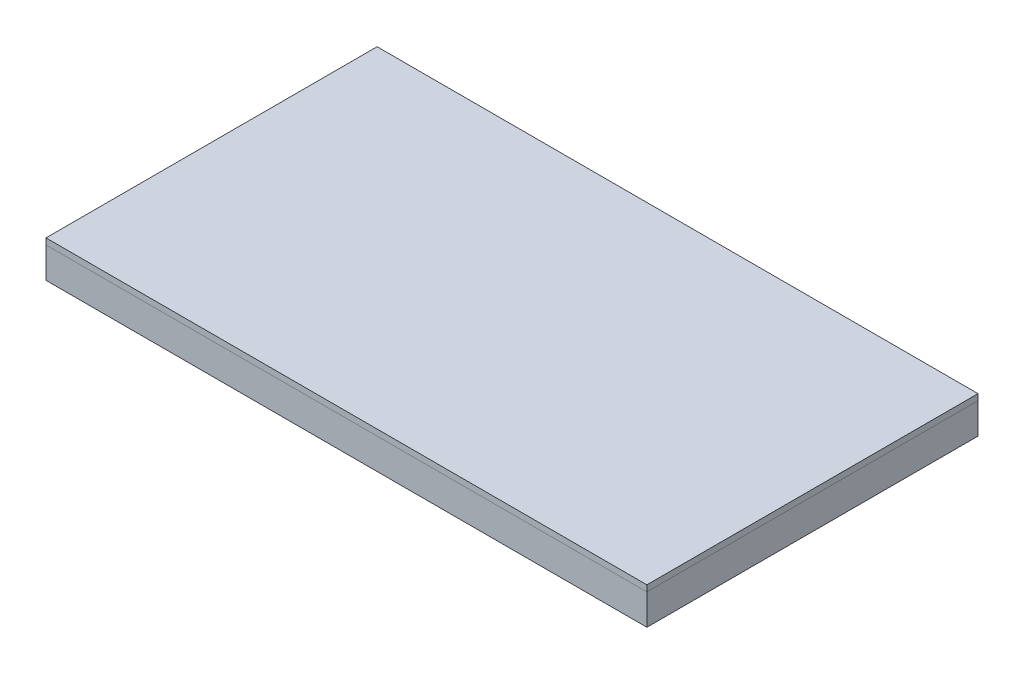
ISO-10303-21;
HEADER;
FILE_DESCRIPTION(('STEP AP214'),'2;1');
FILE_NAME('part.step','',(''),(''),'','','');
FILE_SCHEMA(('AUTOMOTIVE_DESIGN { 1 0 10303 214 1 1 1 1 }'));
ENDSEC;
DATA;
#1=APPLICATION_CONTEXT('core data for automotive mechanical design processes');
#2=APPLICATION_PROTOCOL_DEFINITION('international standard','automotive_design',2000,#1);
#3=PRODUCT_CONTEXT('',#1,'mechanical');
#4=PRODUCT('Part','Part','',(#3));
#5=PRODUCT_RELATED_PRODUCT_CATEGORY('part','',(#4));
#6=PRODUCT_DEFINITION_FORMATION('','',#4);
#7=PRODUCT_DEFINITION_CONTEXT('part definition',#1,'design');
#8=PRODUCT_DEFINITION('design','',#6,#7);
#9=PRODUCT_DEFINITION_SHAPE('','',#8);
#10=(LENGTH_UNIT() NAMED_UNIT(*) SI_UNIT(.MILLI.,.METRE.));
#11=(NAMED_UNIT(*) PLANE_ANGLE_UNIT() SI_UNIT($,.RADIAN.));
#12=(NAMED_UNIT(*) SI_UNIT($,.STERADIAN.) SOLID_ANGLE_UNIT());
#13=UNCERTAINTY_MEASURE_WITH_UNIT(LENGTH_MEASURE(1.E-05),#10,'distance_accuracy_value','');
#14=(GEOMETRIC_REPRESENTATION_CONTEXT(3) GLOBAL_UNCERTAINTY_ASSIGNED_CONTEXT((#13)) GLOBAL_UNIT_ASSIGNED_CONTEXT((#10,
#11,#12)) REPRESENTATION_CONTEXT('',''));
#15=CARTESIAN_POINT('',(0.,0.,0.));
#16=DIRECTION('',(0.,0.,1.));
#17=DIRECTION('',(1.,0.,0.));
#18=AXIS2_PLACEMENT_3D('',#15,#16,#17);
#19=CARTESIAN_POINT('',(490.,-50.,270.));
#20=DIRECTION('',(1.,0.,0.));
#21=DIRECTION('',(0.,0.,-1.));
#22=AXIS2_PLACEMENT_3D('',#19,#20,#21);
#23=PLANE('',#22);
#24=DIRECTION('',(0.,0.,-1.));
#25=VECTOR('',#24,1.);
#26=CARTESIAN_POINT('',(490.,0.,270.));
#27=LINE('',#26,#25);
#28=CARTESIAN_POINT('',(490.,0.,270.));
#29=VERTEX_POINT('',#28);
#30=CARTESIAN_POINT('',(490.,0.,-270.));
#31=VERTEX_POINT('',#30);
#32=EDGE_CURVE('E149',#29,#31,#27,.T.);
#33=ORIENTED_EDGE('',*,*,#32,.F.);
#34=DIRECTION('',(0.,1.,0.));
#35=VECTOR('',#34,1.);
#36=CARTESIAN_POINT('',(490.,-50.,270.));
#37=LINE('',#36,#35);
#38=CARTESIAN_POINT('',(490.,-50.,270.));
#39=VERTEX_POINT('',#38);
#40=EDGE_CURVE('E12',#39,#29,#37,.T.);
#41=ORIENTED_EDGE('',*,*,#40,.F.);
#42=DIRECTION('',(0.,0.,-1.));
#43=VECTOR('',#42,1.);
#44=CARTESIAN_POINT('',(490.,-50.,270.));
#45=LINE('',#44,#43);
#46=CARTESIAN_POINT('',(490.,-50.,-270.));
#47=VERTEX_POINT('',#46);
#48=EDGE_CURVE('E153',#39,#47,#45,.T.);
#49=ORIENTED_EDGE('',*,*,#48,.T.);
#50=DIRECTION('',(0.,1.,0.));
#51=VECTOR('',#50,1.);
#52=CARTESIAN_POINT('',(490.,-50.,-270.));
#53=LINE('',#52,#51);
#54=EDGE_CURVE('E54',#47,#31,#53,.T.);
#55=ORIENTED_EDGE('',*,*,#54,.T.);
#56=EDGE_LOOP('',(#33,#41,#49,#55));
#57=FACE_BOUND('',#56,.T.);
#58=ADVANCED_FACE('F51',(#57),#23,.T.);
#59=CARTESIAN_POINT('',(-490.,-50.,270.));
#60=DIRECTION('',(0.,0.,1.));
#61=DIRECTION('',(1.,0.,0.));
#62=AXIS2_PLACEMENT_3D('',#59,#60,#61);
#63=PLANE('',#62);
#64=DIRECTION('',(1.,0.,0.));
#65=VECTOR('',#64,1.);
#66=CARTESIAN_POINT('',(-490.,0.,270.));
#67=LINE('',#66,#65);
#68=CARTESIAN_POINT('',(-490.,0.,270.));
#69=VERTEX_POINT('',#68);
#70=EDGE_CURVE('E157',#69,#29,#67,.T.);
#71=ORIENTED_EDGE('',*,*,#70,.F.);
#72=DIRECTION('',(0.,1.,0.));
#73=VECTOR('',#72,1.);
#74=CARTESIAN_POINT('',(-490.,-50.,270.));
#75=LINE('',#74,#73);
#76=CARTESIAN_POINT('',(-490.,-50.,270.));
#77=VERTEX_POINT('',#76);
#78=EDGE_CURVE('E59',#77,#69,#75,.T.);
#79=ORIENTED_EDGE('',*,*,#78,.F.);
#80=DIRECTION('',(1.,0.,0.));
#81=VECTOR('',#80,1.);
#82=CARTESIAN_POINT('',(-490.,-50.,270.));
#83=LINE('',#82,#81);
#84=EDGE_CURVE('E163',#77,#39,#83,.T.);
#85=ORIENTED_EDGE('',*,*,#84,.T.);
#86=ORIENTED_EDGE('',*,*,#40,.T.);
#87=EDGE_LOOP('',(#71,#79,#85,#86));
#88=FACE_BOUND('',#87,.T.);
#89=ADVANCED_FACE('F189',(#88),#63,.T.);
#90=CARTESIAN_POINT('',(-490.,-50.,270.));
#91=DIRECTION('',(-1.,0.,0.));
#92=DIRECTION('',(0.,0.,1.));
#93=AXIS2_PLACEMENT_3D('',#90,#91,#92);
#94=PLANE('',#93);
#95=DIRECTION('',(0.,0.,1.));
#96=VECTOR('',#95,1.);
#97=CARTESIAN_POINT('',(-490.,0.,270.));
#98=LINE('',#97,#96);
#99=CARTESIAN_POINT('',(-490.,0.,-270.));
#100=VERTEX_POINT('',#99);
#101=EDGE_CURVE('E171',#100,#69,#98,.T.);
#102=ORIENTED_EDGE('',*,*,#101,.F.);
#103=DIRECTION('',(0.,1.,0.));
#104=VECTOR('',#103,1.);
#105=CARTESIAN_POINT('',(-490.,-50.,-270.));
#106=LINE('',#105,#104);
#107=CARTESIAN_POINT('',(-490.,-50.,-270.));
#108=VERTEX_POINT('',#107);
#109=EDGE_CURVE('E176',#108,#100,#106,.T.);
#110=ORIENTED_EDGE('',*,*,#109,.F.);
#111=DIRECTION('',(0.,0.,1.));
#112=VECTOR('',#111,1.);
#113=CARTESIAN_POINT('',(-490.,-50.,270.));
#114=LINE('',#113,#112);
#115=EDGE_CURVE('E160',#108,#77,#114,.T.);
#116=ORIENTED_EDGE('',*,*,#115,.T.);
#117=ORIENTED_EDGE('',*,*,#78,.T.);
#118=EDGE_LOOP('',(#102,#110,#116,#117));
#119=FACE_BOUND('',#118,.T.);
#120=ADVANCED_FACE('F193',(#119),#94,.T.);
#121=CARTESIAN_POINT('',(-490.,-50.,-270.));
#122=DIRECTION('',(0.,0.,-1.));
#123=DIRECTION('',(-1.,0.,0.));
#124=AXIS2_PLACEMENT_3D('',#121,#122,#123);
#125=PLANE('',#124);
#126=DIRECTION('',(-1.,0.,0.));
#127=VECTOR('',#126,1.);
#128=CARTESIAN_POINT('',(-490.,0.,-270.));
#129=LINE('',#128,#127);
#130=EDGE_CURVE('E168',#31,#100,#129,.T.);
#131=ORIENTED_EDGE('',*,*,#130,.F.);
#132=ORIENTED_EDGE('',*,*,#54,.F.);
#133=DIRECTION('',(-1.,0.,0.));
#134=VECTOR('',#133,1.);
#135=CARTESIAN_POINT('',(-490.,-50.,-270.));
#136=LINE('',#135,#134);
#137=EDGE_CURVE('E156',#47,#108,#136,.T.);
#138=ORIENTED_EDGE('',*,*,#137,.T.);
#139=ORIENTED_EDGE('',*,*,#109,.T.);
#140=EDGE_LOOP('',(#131,#132,#138,#139));
#141=FACE_BOUND('',#140,.T.);
#142=ADVANCED_FACE('F184',(#141),#125,.T.);
#143=CARTESIAN_POINT('',(0.,-50.,0.));
#144=DIRECTION('',(0.,-1.,0.));
#145=DIRECTION('',(0.,0.,-1.));
#146=AXIS2_PLACEMENT_3D('',#143,#144,#145);
#147=PLANE('',#146);
#148=DIRECTION('',(0.,0.,-1.));
#149=VECTOR('',#148,1.);
#150=CARTESIAN_POINT('',(480.,-50.,260.));
#151=LINE('',#150,#149);
#152=CARTESIAN_POINT('',(480.,-50.,260.));
#153=VERTEX_POINT('',#152);
#154=CARTESIAN_POINT('',(480.,-50.,-260.));
#155=VERTEX_POINT('',#154);
#156=EDGE_CURVE('E118',#153,#155,#151,.T.);
#157=ORIENTED_EDGE('',*,*,#156,.T.);
#158=DIRECTION('',(-1.,0.,0.));
#159=VECTOR('',#158,1.);
#160=CARTESIAN_POINT('',(-480.,-50.,-260.));
#161=LINE('',#160,#159);
#162=CARTESIAN_POINT('',(-480.,-50.,-260.));
#163=VERTEX_POINT('',#162);
#164=EDGE_CURVE('E127',#155,#163,#161,.T.);
#165=ORIENTED_EDGE('',*,*,#164,.T.);
#166=DIRECTION('',(0.,0.,1.));
#167=VECTOR('',#166,1.);
#168=CARTESIAN_POINT('',(-480.,-50.,260.));
#169=LINE('',#168,#167);
#170=CARTESIAN_POINT('',(-480.,-50.,260.));
#171=VERTEX_POINT('',#170);
#172=EDGE_CURVE('E67',#163,#171,#169,.T.);
#173=ORIENTED_EDGE('',*,*,#172,.T.);
#174=DIRECTION('',(1.,0.,0.));
#175=VECTOR('',#174,1.);
#176=CARTESIAN_POINT('',(-480.,-50.,260.));
#177=LINE('',#176,#175);
#178=EDGE_CURVE('E124',#171,#153,#177,.T.);
#179=ORIENTED_EDGE('',*,*,#178,.T.);
#180=EDGE_LOOP('',(#157,#165,#173,#179));
#181=FACE_BOUND('',#180,.T.);
#182=ORIENTED_EDGE('',*,*,#48,.F.);
#183=ORIENTED_EDGE('',*,*,#84,.F.);
#184=ORIENTED_EDGE('',*,*,#115,.F.);
#185=ORIENTED_EDGE('',*,*,#137,.F.);
#186=EDGE_LOOP('',(#182,#183,#184,#185));
#187=FACE_BOUND('',#186,.T.);
#188=ADVANCED_FACE('F131',(#181,#187),#147,.T.);
#189=CARTESIAN_POINT('',(0.,0.,0.));
#190=DIRECTION('',(0.,-1.,0.));
#191=DIRECTION('',(0.,0.,-1.));
#192=AXIS2_PLACEMENT_3D('',#189,#190,#191);
#193=PLANE('',#192);
#194=DIRECTION('',(-1.,0.,0.));
#195=VECTOR('',#194,1.);
#196=CARTESIAN_POINT('',(-480.,0.,-260.));
#197=LINE('',#196,#195);
#198=CARTESIAN_POINT('',(480.,0.,-260.));
#199=VERTEX_POINT('',#198);
#200=CARTESIAN_POINT('',(-480.,0.,-260.));
#201=VERTEX_POINT('',#200);
#202=EDGE_CURVE('E143',#199,#201,#197,.T.);
#203=ORIENTED_EDGE('',*,*,#202,.F.);
#204=DIRECTION('',(0.,0.,-1.));
#205=VECTOR('',#204,1.);
#206=CARTESIAN_POINT('',(480.,0.,260.));
#207=LINE('',#206,#205);
#208=CARTESIAN_POINT('',(480.,0.,260.));
#209=VERTEX_POINT('',#208);
#210=EDGE_CURVE('E75',#209,#199,#207,.T.);
#211=ORIENTED_EDGE('',*,*,#210,.F.);
#212=DIRECTION('',(1.,0.,0.));
#213=VECTOR('',#212,1.);
#214=CARTESIAN_POINT('',(-480.,0.,260.));
#215=LINE('',#214,#213);
#216=CARTESIAN_POINT('',(-480.,0.,260.));
#217=VERTEX_POINT('',#216);
#218=EDGE_CURVE('E134',#217,#209,#215,.T.);
#219=ORIENTED_EDGE('',*,*,#218,.F.);
#220=DIRECTION('',(0.,0.,1.));
#221=VECTOR('',#220,1.);
#222=CARTESIAN_POINT('',(-480.,0.,260.));
#223=LINE('',#222,#221);
#224=EDGE_CURVE('E137',#201,#217,#223,.T.);
#225=ORIENTED_EDGE('',*,*,#224,.F.);
#226=EDGE_LOOP('',(#203,#211,#219,#225));
#227=FACE_BOUND('',#226,.T.);
#228=ORIENTED_EDGE('',*,*,#32,.T.);
#229=ORIENTED_EDGE('',*,*,#130,.T.);
#230=ORIENTED_EDGE('',*,*,#101,.T.);
#231=ORIENTED_EDGE('',*,*,#70,.T.);
#232=EDGE_LOOP('',(#228,#229,#230,#231));
#233=FACE_BOUND('',#232,.T.);
#234=ADVANCED_FACE('F186',(#227,#233),#193,.F.);
#235=CARTESIAN_POINT('',(480.,-50.,260.));
#236=DIRECTION('',(1.,0.,0.));
#237=DIRECTION('',(0.,0.,-1.));
#238=AXIS2_PLACEMENT_3D('',#235,#236,#237);
#239=PLANE('',#238);
#240=ORIENTED_EDGE('',*,*,#210,.T.);
#241=DIRECTION('',(0.,1.,0.));
#242=VECTOR('',#241,1.);
#243=CARTESIAN_POINT('',(480.,-50.,-260.));
#244=LINE('',#243,#242);
#245=EDGE_CURVE('E114',#155,#199,#244,.T.);
#246=ORIENTED_EDGE('',*,*,#245,.F.);
#247=ORIENTED_EDGE('',*,*,#156,.F.);
#248=DIRECTION('',(0.,1.,0.));
#249=VECTOR('',#248,1.);
#250=CARTESIAN_POINT('',(480.,-50.,260.));
#251=LINE('',#250,#249);
#252=EDGE_CURVE('E147',#153,#209,#251,.T.);
#253=ORIENTED_EDGE('',*,*,#252,.T.);
#254=EDGE_LOOP('',(#240,#246,#247,#253));
#255=FACE_BOUND('',#254,.T.);
#256=ADVANCED_FACE('F116',(#255),#239,.F.);
#257=CARTESIAN_POINT('',(-480.,-50.,260.));
#258=DIRECTION('',(0.,0.,1.));
#259=DIRECTION('',(1.,0.,0.));
#260=AXIS2_PLACEMENT_3D('',#257,#258,#259);
#261=PLANE('',#260);
#262=ORIENTED_EDGE('',*,*,#218,.T.);
#263=ORIENTED_EDGE('',*,*,#252,.F.);
#264=ORIENTED_EDGE('',*,*,#178,.F.);
#265=DIRECTION('',(0.,1.,0.));
#266=VECTOR('',#265,1.);
#267=CARTESIAN_POINT('',(-480.,-50.,260.));
#268=LINE('',#267,#266);
#269=EDGE_CURVE('E150',#171,#217,#268,.T.);
#270=ORIENTED_EDGE('',*,*,#269,.T.);
#271=EDGE_LOOP('',(#262,#263,#264,#270));
#272=FACE_BOUND('',#271,.T.);
#273=ADVANCED_FACE('F244',(#272),#261,.F.);
#274=CARTESIAN_POINT('',(-480.,-50.,260.));
#275=DIRECTION('',(-1.,0.,0.));
#276=DIRECTION('',(0.,0.,1.));
#277=AXIS2_PLACEMENT_3D('',#274,#275,#276);
#278=PLANE('',#277);
#279=ORIENTED_EDGE('',*,*,#224,.T.);
#280=ORIENTED_EDGE('',*,*,#269,.F.);
#281=ORIENTED_EDGE('',*,*,#172,.F.);
#282=DIRECTION('',(0.,1.,0.));
#283=VECTOR('',#282,1.);
#284=CARTESIAN_POINT('',(-480.,-50.,-260.));
#285=LINE('',#284,#283);
#286=EDGE_CURVE('E123',#163,#201,#285,.T.);
#287=ORIENTED_EDGE('',*,*,#286,.T.);
#288=EDGE_LOOP('',(#279,#280,#281,#287));
#289=FACE_BOUND('',#288,.T.);
#290=ADVANCED_FACE('F253',(#289),#278,.F.);
#291=CARTESIAN_POINT('',(-480.,-50.,-260.));
#292=DIRECTION('',(0.,0.,-1.));
#293=DIRECTION('',(-1.,0.,0.));
#294=AXIS2_PLACEMENT_3D('',#291,#292,#293);
#295=PLANE('',#294);
#296=ORIENTED_EDGE('',*,*,#202,.T.);
#297=ORIENTED_EDGE('',*,*,#286,.F.);
#298=ORIENTED_EDGE('',*,*,#164,.F.);
#299=ORIENTED_EDGE('',*,*,#245,.T.);
#300=EDGE_LOOP('',(#296,#297,#298,#299));
#301=FACE_BOUND('',#300,.T.);
#302=ADVANCED_FACE('F128',(#301),#295,.F.);
#303=CLOSED_SHELL('',(#58,#89,#120,#142,#188,#234,#256,#273,#290,#302));
#304=MANIFOLD_SOLID_BREP('B2',#303);
#305=CARTESIAN_POINT('',(0.,10.,270.));
#306=DIRECTION('',(0.,0.,-1.));
#307=DIRECTION('',(-1.,0.,0.));
#308=AXIS2_PLACEMENT_3D('',#305,#306,#307);
#309=PLANE('',#308);
#310=DIRECTION('',(1.,0.,0.));
#311=VECTOR('',#310,1.);
#312=CARTESIAN_POINT('',(0.,0.,270.));
#313=LINE('',#312,#311);
#314=CARTESIAN_POINT('',(-490.,0.,270.));
#315=VERTEX_POINT('',#314);
#316=CARTESIAN_POINT('',(490.,0.,270.));
#317=VERTEX_POINT('',#316);
#318=EDGE_CURVE('E349',#315,#317,#313,.T.);
#319=ORIENTED_EDGE('',*,*,#318,.T.);
#320=DIRECTION('',(0.,-1.,0.));
#321=VECTOR('',#320,1.);
#322=CARTESIAN_POINT('',(490.,10.,270.));
#323=LINE('',#322,#321);
#324=CARTESIAN_POINT('',(490.,10.,270.));
#325=VERTEX_POINT('',#324);
#326=EDGE_CURVE('E49',#325,#317,#323,.T.);
#327=ORIENTED_EDGE('',*,*,#326,.F.);
#328=DIRECTION('',(1.,0.,0.));
#329=VECTOR('',#328,1.);
#330=CARTESIAN_POINT('',(0.,10.,270.));
#331=LINE('',#330,#329);
#332=CARTESIAN_POINT('',(-490.,10.,270.));
#333=VERTEX_POINT('',#332);
#334=EDGE_CURVE('E331',#333,#325,#331,.T.);
#335=ORIENTED_EDGE('',*,*,#334,.F.);
#336=DIRECTION('',(0.,-1.,0.));
#337=VECTOR('',#336,1.);
#338=CARTESIAN_POINT('',(-490.,10.,270.));
#339=LINE('',#338,#337);
#340=EDGE_CURVE('E298',#333,#315,#339,.T.);
#341=ORIENTED_EDGE('',*,*,#340,.T.);
#342=EDGE_LOOP('',(#319,#327,#335,#341));
#343=FACE_BOUND('',#342,.T.);
#344=ADVANCED_FACE('F281',(#343),#309,.F.);
#345=CARTESIAN_POINT('',(490.,10.,0.));
#346=DIRECTION('',(-1.,0.,0.));
#347=DIRECTION('',(0.,0.,1.));
#348=AXIS2_PLACEMENT_3D('',#345,#346,#347);
#349=PLANE('',#348);
#350=DIRECTION('',(0.,0.,-1.));
#351=VECTOR('',#350,1.);
#352=CARTESIAN_POINT('',(490.,0.,0.));
#353=LINE('',#352,#351);
#354=CARTESIAN_POINT('',(490.,0.,-270.));
#355=VERTEX_POINT('',#354);
#356=EDGE_CURVE('E337',#317,#355,#353,.T.);
#357=ORIENTED_EDGE('',*,*,#356,.T.);
#358=DIRECTION('',(0.,-1.,0.));
#359=VECTOR('',#358,1.);
#360=CARTESIAN_POINT('',(490.,10.,-270.));
#361=LINE('',#360,#359);
#362=CARTESIAN_POINT('',(490.,10.,-270.));
#363=VERTEX_POINT('',#362);
#364=EDGE_CURVE('E290',#363,#355,#361,.T.);
#365=ORIENTED_EDGE('',*,*,#364,.F.);
#366=DIRECTION('',(0.,0.,-1.));
#367=VECTOR('',#366,1.);
#368=CARTESIAN_POINT('',(490.,10.,0.));
#369=LINE('',#368,#367);
#370=EDGE_CURVE('E323',#325,#363,#369,.T.);
#371=ORIENTED_EDGE('',*,*,#370,.F.);
#372=ORIENTED_EDGE('',*,*,#326,.T.);
#373=EDGE_LOOP('',(#357,#365,#371,#372));
#374=FACE_BOUND('',#373,.T.);
#375=ADVANCED_FACE('F336',(#374),#349,.F.);
#376=CARTESIAN_POINT('',(0.,10.,-270.));
#377=DIRECTION('',(0.,0.,-1.));
#378=DIRECTION('',(-1.,0.,0.));
#379=AXIS2_PLACEMENT_3D('',#376,#377,#378);
#380=PLANE('',#379);
#381=DIRECTION('',(1.,0.,0.));
#382=VECTOR('',#381,1.);
#383=CARTESIAN_POINT('',(0.,0.,-270.));
#384=LINE('',#383,#382);
#385=CARTESIAN_POINT('',(-490.,0.,-270.));
#386=VERTEX_POINT('',#385);
#387=EDGE_CURVE('E354',#386,#355,#384,.T.);
#388=ORIENTED_EDGE('',*,*,#387,.F.);
#389=DIRECTION('',(0.,-1.,0.));
#390=VECTOR('',#389,1.);
#391=CARTESIAN_POINT('',(-490.,10.,-270.));
#392=LINE('',#391,#390);
#393=CARTESIAN_POINT('',(-490.,10.,-270.));
#394=VERTEX_POINT('',#393);
#395=EDGE_CURVE('E312',#394,#386,#392,.T.);
#396=ORIENTED_EDGE('',*,*,#395,.F.);
#397=DIRECTION('',(1.,0.,0.));
#398=VECTOR('',#397,1.);
#399=CARTESIAN_POINT('',(0.,10.,-270.));
#400=LINE('',#399,#398);
#401=EDGE_CURVE('E330',#394,#363,#400,.T.);
#402=ORIENTED_EDGE('',*,*,#401,.T.);
#403=ORIENTED_EDGE('',*,*,#364,.T.);
#404=EDGE_LOOP('',(#388,#396,#402,#403));
#405=FACE_BOUND('',#404,.T.);
#406=ADVANCED_FACE('F341',(#405),#380,.T.);
#407=CARTESIAN_POINT('',(-490.,10.,0.));
#408=DIRECTION('',(-1.,0.,0.));
#409=DIRECTION('',(0.,0.,1.));
#410=AXIS2_PLACEMENT_3D('',#407,#408,#409);
#411=PLANE('',#410);
#412=DIRECTION('',(0.,0.,-1.));
#413=VECTOR('',#412,1.);
#414=CARTESIAN_POINT('',(-490.,0.,0.));
#415=LINE('',#414,#413);
#416=EDGE_CURVE('E357',#315,#386,#415,.T.);
#417=ORIENTED_EDGE('',*,*,#416,.F.);
#418=ORIENTED_EDGE('',*,*,#340,.F.);
#419=DIRECTION('',(0.,0.,-1.));
#420=VECTOR('',#419,1.);
#421=CARTESIAN_POINT('',(-490.,10.,0.));
#422=LINE('',#421,#420);
#423=EDGE_CURVE('E343',#333,#394,#422,.T.);
#424=ORIENTED_EDGE('',*,*,#423,.T.);
#425=ORIENTED_EDGE('',*,*,#395,.T.);
#426=EDGE_LOOP('',(#417,#418,#424,#425));
#427=FACE_BOUND('',#426,.T.);
#428=ADVANCED_FACE('F367',(#427),#411,.T.);
#429=CARTESIAN_POINT('',(0.,10.,0.));
#430=DIRECTION('',(0.,1.,0.));
#431=DIRECTION('',(0.,0.,1.));
#432=AXIS2_PLACEMENT_3D('',#429,#430,#431);
#433=PLANE('',#432);
#434=ORIENTED_EDGE('',*,*,#334,.T.);
#435=ORIENTED_EDGE('',*,*,#370,.T.);
#436=ORIENTED_EDGE('',*,*,#401,.F.);
#437=ORIENTED_EDGE('',*,*,#423,.F.);
#438=EDGE_LOOP('',(#434,#435,#436,#437));
#439=FACE_BOUND('',#438,.T.);
#440=ADVANCED_FACE('F327',(#439),#433,.T.);
#441=CARTESIAN_POINT('',(0.,0.,0.));
#442=DIRECTION('',(0.,1.,0.));
#443=DIRECTION('',(0.,0.,1.));
#444=AXIS2_PLACEMENT_3D('',#441,#442,#443);
#445=PLANE('',#444);
#446=ORIENTED_EDGE('',*,*,#318,.F.);
#447=ORIENTED_EDGE('',*,*,#416,.T.);
#448=ORIENTED_EDGE('',*,*,#387,.T.);
#449=ORIENTED_EDGE('',*,*,#356,.F.);
#450=EDGE_LOOP('',(#446,#447,#448,#449));
#451=FACE_BOUND('',#450,.T.);
#452=ADVANCED_FACE('F366',(#451),#445,.F.);
#453=CLOSED_SHELL('',(#344,#375,#406,#428,#440,#452));
#454=MANIFOLD_SOLID_BREP('B6',#453);
#455=ADVANCED_BREP_SHAPE_REPRESENTATION('',(#18,#304,#454),#14);
#456=SHAPE_DEFINITION_REPRESENTATION(#9,#455);
ENDSEC;
END-ISO-10303-21;
